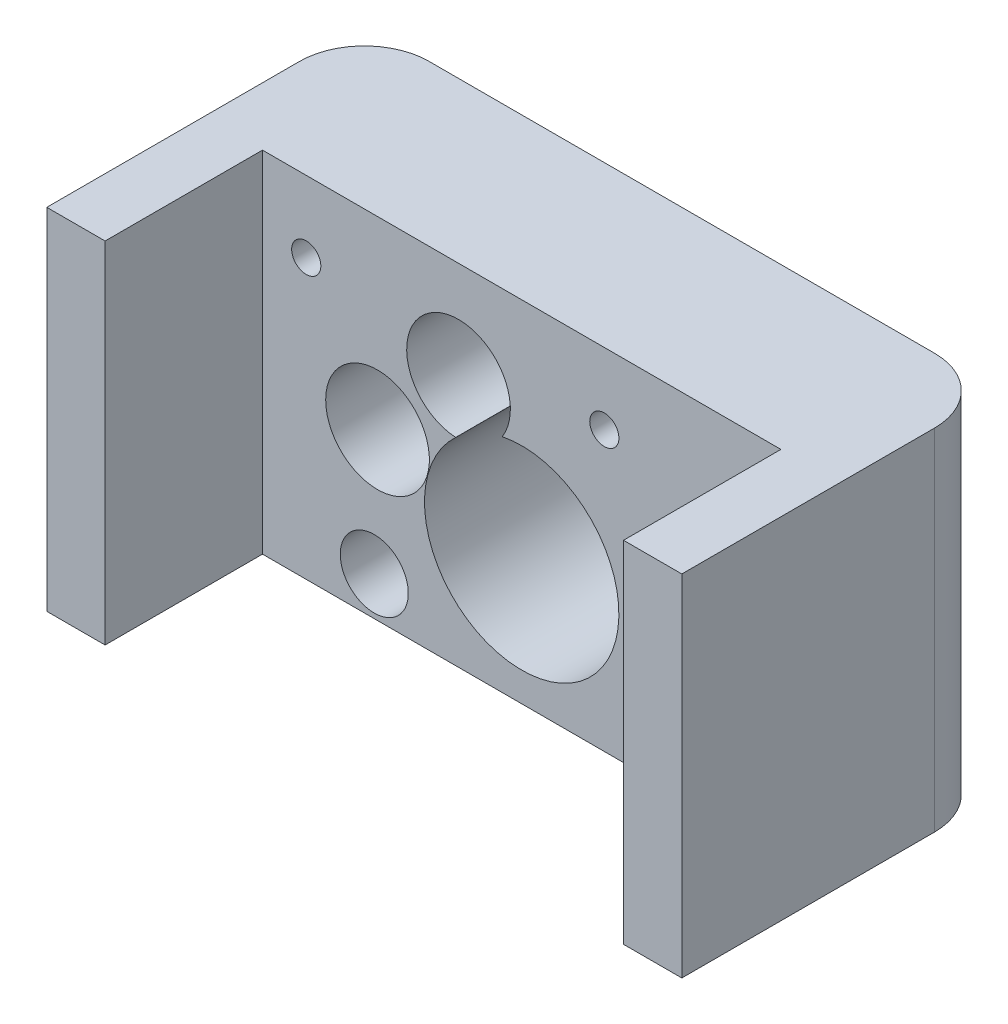
ISO-10303-21;
HEADER;
FILE_DESCRIPTION(('STEP AP214'),'2;1');
FILE_NAME('part.step','',(''),(''),'','','');
FILE_SCHEMA(('AUTOMOTIVE_DESIGN { 1 0 10303 214 1 1 1 1 }'));
ENDSEC;
DATA;
#1=APPLICATION_CONTEXT('core data for automotive mechanical design processes');
#2=APPLICATION_PROTOCOL_DEFINITION('international standard','automotive_design',2000,#1);
#3=PRODUCT_CONTEXT('',#1,'mechanical');
#4=PRODUCT('Part','Part','',(#3));
#5=PRODUCT_RELATED_PRODUCT_CATEGORY('part','',(#4));
#6=PRODUCT_DEFINITION_FORMATION('','',#4);
#7=PRODUCT_DEFINITION_CONTEXT('part definition',#1,'design');
#8=PRODUCT_DEFINITION('design','',#6,#7);
#9=PRODUCT_DEFINITION_SHAPE('','',#8);
#10=(LENGTH_UNIT() NAMED_UNIT(*) SI_UNIT(.MILLI.,.METRE.));
#11=(NAMED_UNIT(*) PLANE_ANGLE_UNIT() SI_UNIT($,.RADIAN.));
#12=(NAMED_UNIT(*) SI_UNIT($,.STERADIAN.) SOLID_ANGLE_UNIT());
#13=UNCERTAINTY_MEASURE_WITH_UNIT(LENGTH_MEASURE(1.E-05),#10,'distance_accuracy_value','');
#14=(GEOMETRIC_REPRESENTATION_CONTEXT(3) GLOBAL_UNCERTAINTY_ASSIGNED_CONTEXT((#13)) GLOBAL_UNIT_ASSIGNED_CONTEXT((#10,
#11,#12)) REPRESENTATION_CONTEXT('',''));
#15=CARTESIAN_POINT('',(0.,0.,0.));
#16=DIRECTION('',(0.,0.,1.));
#17=DIRECTION('',(1.,0.,0.));
#18=AXIS2_PLACEMENT_3D('',#15,#16,#17);
#19=CARTESIAN_POINT('',(0.,0.,49.));
#20=DIRECTION('',(0.,0.,1.));
#21=DIRECTION('',(1.,0.,0.));
#22=AXIS2_PLACEMENT_3D('',#19,#20,#21);
#23=PLANE('',#22);
#24=DIRECTION('',(0.,-1.,0.));
#25=VECTOR('',#24,1.);
#26=CARTESIAN_POINT('',(-35.5216278441966,41.4342339093289,49.));
#27=LINE('',#26,#25);
#28=CARTESIAN_POINT('',(-35.5216278441966,41.4342339093289,49.));
#29=VERTEX_POINT('',#28);
#30=CARTESIAN_POINT('',(-35.5216278441966,-12.5657660906711,49.));
#31=VERTEX_POINT('',#30);
#32=EDGE_CURVE('E125',#29,#31,#27,.T.);
#33=ORIENTED_EDGE('',*,*,#32,.T.);
#34=DIRECTION('',(1.,0.,0.));
#35=VECTOR('',#34,1.);
#36=CARTESIAN_POINT('',(0.,-12.5657660906711,49.));
#37=LINE('',#36,#35);
#38=CARTESIAN_POINT('',(-26.5219738470243,-12.5657660906711,49.));
#39=VERTEX_POINT('',#38);
#40=EDGE_CURVE('E182',#31,#39,#37,.T.);
#41=ORIENTED_EDGE('',*,*,#40,.T.);
#42=DIRECTION('',(0.,1.,0.));
#43=VECTOR('',#42,1.);
#44=CARTESIAN_POINT('',(-26.5219738470243,0.,49.));
#45=LINE('',#44,#43);
#46=CARTESIAN_POINT('',(-26.5219738470243,41.4342339093289,49.));
#47=VERTEX_POINT('',#46);
#48=EDGE_CURVE('E147',#39,#47,#45,.T.);
#49=ORIENTED_EDGE('',*,*,#48,.T.);
#50=DIRECTION('',(-1.,0.,0.));
#51=VECTOR('',#50,1.);
#52=CARTESIAN_POINT('',(0.,41.4342339093289,49.));
#53=LINE('',#52,#51);
#54=EDGE_CURVE('E142',#47,#29,#53,.T.);
#55=ORIENTED_EDGE('',*,*,#54,.T.);
#56=EDGE_LOOP('',(#33,#41,#49,#55));
#57=FACE_BOUND('',#56,.T.);
#58=ADVANCED_FACE('F35',(#57),#23,.T.);
#59=CARTESIAN_POINT('',(0.,-12.5657660906711,49.));
#60=DIRECTION('',(0.,1.,0.));
#61=DIRECTION('',(0.,0.,1.));
#62=AXIS2_PLACEMENT_3D('',#59,#60,#61);
#63=PLANE('',#62);
#64=ORIENTED_EDGE('',*,*,#40,.F.);
#65=DIRECTION('',(0.,0.,1.));
#66=VECTOR('',#65,1.);
#67=CARTESIAN_POINT('',(-35.5216278441966,-12.5657660906711,49.));
#68=LINE('',#67,#66);
#69=CARTESIAN_POINT('',(-35.5216278441966,-12.5657660906711,24.7098819042502));
#70=VERTEX_POINT('',#69);
#71=EDGE_CURVE('E131',#70,#31,#68,.T.);
#72=ORIENTED_EDGE('',*,*,#71,.F.);
#73=DIRECTION('',(1.,0.,0.));
#74=VECTOR('',#73,1.);
#75=CARTESIAN_POINT('',(-35.5216278441966,-12.5657660906711,24.7098819042502));
#76=LINE('',#75,#74);
#77=CARTESIAN_POINT('',(-115.521627845181,-12.5657660906711,24.7098819042502));
#78=VERTEX_POINT('',#77);
#79=EDGE_CURVE('E144',#78,#70,#76,.T.);
#80=ORIENTED_EDGE('',*,*,#79,.F.);
#81=DIRECTION('',(0.,0.,-1.));
#82=VECTOR('',#81,1.);
#83=CARTESIAN_POINT('',(-115.521627845181,-12.5657660906711,49.));
#84=LINE('',#83,#82);
#85=CARTESIAN_POINT('',(-115.521627845181,-12.5657660906711,49.));
#86=VERTEX_POINT('',#85);
#87=EDGE_CURVE('E258',#86,#78,#84,.T.);
#88=ORIENTED_EDGE('',*,*,#87,.F.);
#89=CARTESIAN_POINT('',(-124.521973847024,-12.5657660906711,49.));
#90=VERTEX_POINT('',#89);
#91=EDGE_CURVE('E236',#90,#86,#37,.T.);
#92=ORIENTED_EDGE('',*,*,#91,.F.);
#93=DIRECTION('',(0.,0.,-1.));
#94=VECTOR('',#93,1.);
#95=CARTESIAN_POINT('',(-124.521973847024,-12.5657660906711,49.));
#96=LINE('',#95,#94);
#97=CARTESIAN_POINT('',(-124.521973847024,-12.5657660906711,10.));
#98=VERTEX_POINT('',#97);
#99=EDGE_CURVE('E183',#90,#98,#96,.T.);
#100=ORIENTED_EDGE('',*,*,#99,.T.);
#101=CARTESIAN_POINT('',(-114.521973847024,-12.5657660906711,10.));
#102=DIRECTION('',(0.,1.,0.));
#103=DIRECTION('',(0.,0.,1.));
#104=AXIS2_PLACEMENT_3D('',#101,#102,#103);
#105=CIRCLE('',#104,10.);
#106=CARTESIAN_POINT('',(-114.521973847024,-12.5657660906711,0.));
#107=VERTEX_POINT('',#106);
#108=EDGE_CURVE('E202',#98,#107,#105,.F.);
#109=ORIENTED_EDGE('',*,*,#108,.T.);
#110=DIRECTION('',(1.,0.,0.));
#111=VECTOR('',#110,1.);
#112=CARTESIAN_POINT('',(0.,-12.5657660906711,0.));
#113=LINE('',#112,#111);
#114=CARTESIAN_POINT('',(-36.5219738470243,-12.5657660906711,0.));
#115=VERTEX_POINT('',#114);
#116=EDGE_CURVE('E173',#107,#115,#113,.T.);
#117=ORIENTED_EDGE('',*,*,#116,.T.);
#118=CARTESIAN_POINT('',(-36.5219738470243,-12.5657660906711,10.));
#119=DIRECTION('',(0.,1.,0.));
#120=DIRECTION('',(0.,0.,1.));
#121=AXIS2_PLACEMENT_3D('',#118,#119,#120);
#122=CIRCLE('',#121,10.);
#123=CARTESIAN_POINT('',(-26.5219738470243,-12.5657660906711,10.));
#124=VERTEX_POINT('',#123);
#125=EDGE_CURVE('E200',#115,#124,#122,.F.);
#126=ORIENTED_EDGE('',*,*,#125,.T.);
#127=DIRECTION('',(0.,0.,-1.));
#128=VECTOR('',#127,1.);
#129=CARTESIAN_POINT('',(-26.5219738470243,-12.5657660906711,49.));
#130=LINE('',#129,#128);
#131=EDGE_CURVE('E192',#39,#124,#130,.T.);
#132=ORIENTED_EDGE('',*,*,#131,.F.);
#133=EDGE_LOOP('',(#64,#72,#80,#88,#92,#100,#109,#117,#126,#132));
#134=FACE_BOUND('',#133,.T.);
#135=ADVANCED_FACE('F224',(#134),#63,.F.);
#136=CARTESIAN_POINT('',(-26.5219738470243,0.,49.));
#137=DIRECTION('',(-1.,0.,0.));
#138=DIRECTION('',(0.,0.,1.));
#139=AXIS2_PLACEMENT_3D('',#136,#137,#138);
#140=PLANE('',#139);
#141=ORIENTED_EDGE('',*,*,#131,.T.);
#142=DIRECTION('',(0.,1.,0.));
#143=VECTOR('',#142,1.);
#144=CARTESIAN_POINT('',(-26.5219738470243,0.,10.));
#145=LINE('',#144,#143);
#146=CARTESIAN_POINT('',(-26.5219738470243,41.4342339093289,10.));
#147=VERTEX_POINT('',#146);
#148=EDGE_CURVE('E11',#124,#147,#145,.T.);
#149=ORIENTED_EDGE('',*,*,#148,.T.);
#150=DIRECTION('',(0.,0.,-1.));
#151=VECTOR('',#150,1.);
#152=CARTESIAN_POINT('',(-26.5219738470243,41.4342339093289,49.));
#153=LINE('',#152,#151);
#154=EDGE_CURVE('E190',#47,#147,#153,.T.);
#155=ORIENTED_EDGE('',*,*,#154,.F.);
#156=ORIENTED_EDGE('',*,*,#48,.F.);
#157=EDGE_LOOP('',(#141,#149,#155,#156));
#158=FACE_BOUND('',#157,.T.);
#159=ADVANCED_FACE('F235',(#158),#140,.F.);
#160=CARTESIAN_POINT('',(0.,41.4342339093289,49.));
#161=DIRECTION('',(0.,-1.,0.));
#162=DIRECTION('',(0.,0.,-1.));
#163=AXIS2_PLACEMENT_3D('',#160,#161,#162);
#164=PLANE('',#163);
#165=DIRECTION('',(1.,0.,0.));
#166=VECTOR('',#165,1.);
#167=CARTESIAN_POINT('',(-35.5216278441966,41.4342339093289,24.7098819042502));
#168=LINE('',#167,#166);
#169=CARTESIAN_POINT('',(-115.521627845181,41.4342339093289,24.7098819042502));
#170=VERTEX_POINT('',#169);
#171=CARTESIAN_POINT('',(-35.5216278441966,41.4342339093289,24.7098819042502));
#172=VERTEX_POINT('',#171);
#173=EDGE_CURVE('E136',#170,#172,#168,.T.);
#174=ORIENTED_EDGE('',*,*,#173,.T.);
#175=DIRECTION('',(0.,0.,1.));
#176=VECTOR('',#175,1.);
#177=CARTESIAN_POINT('',(-35.5216278441966,41.4342339093289,49.));
#178=LINE('',#177,#176);
#179=EDGE_CURVE('E128',#172,#29,#178,.T.);
#180=ORIENTED_EDGE('',*,*,#179,.T.);
#181=ORIENTED_EDGE('',*,*,#54,.F.);
#182=ORIENTED_EDGE('',*,*,#154,.T.);
#183=CARTESIAN_POINT('',(-36.5219738470243,41.4342339093289,10.));
#184=DIRECTION('',(0.,-1.,0.));
#185=DIRECTION('',(0.,0.,-1.));
#186=AXIS2_PLACEMENT_3D('',#183,#184,#185);
#187=CIRCLE('',#186,10.);
#188=CARTESIAN_POINT('',(-36.5219738470243,41.4342339093289,0.));
#189=VERTEX_POINT('',#188);
#190=EDGE_CURVE('E208',#147,#189,#187,.F.);
#191=ORIENTED_EDGE('',*,*,#190,.T.);
#192=DIRECTION('',(-1.,0.,0.));
#193=VECTOR('',#192,1.);
#194=CARTESIAN_POINT('',(0.,41.4342339093289,0.));
#195=LINE('',#194,#193);
#196=CARTESIAN_POINT('',(-114.521973847024,41.4342339093289,0.));
#197=VERTEX_POINT('',#196);
#198=EDGE_CURVE('E176',#189,#197,#195,.T.);
#199=ORIENTED_EDGE('',*,*,#198,.T.);
#200=CARTESIAN_POINT('',(-114.521973847024,41.4342339093289,10.));
#201=DIRECTION('',(0.,-1.,0.));
#202=DIRECTION('',(0.,0.,-1.));
#203=AXIS2_PLACEMENT_3D('',#200,#201,#202);
#204=CIRCLE('',#203,10.);
#205=CARTESIAN_POINT('',(-124.521973847024,41.4342339093289,10.));
#206=VERTEX_POINT('',#205);
#207=EDGE_CURVE('E44',#197,#206,#204,.F.);
#208=ORIENTED_EDGE('',*,*,#207,.T.);
#209=DIRECTION('',(0.,0.,-1.));
#210=VECTOR('',#209,1.);
#211=CARTESIAN_POINT('',(-124.521973847024,41.4342339093289,49.));
#212=LINE('',#211,#210);
#213=CARTESIAN_POINT('',(-124.521973847024,41.4342339093289,49.));
#214=VERTEX_POINT('',#213);
#215=EDGE_CURVE('E186',#214,#206,#212,.T.);
#216=ORIENTED_EDGE('',*,*,#215,.F.);
#217=CARTESIAN_POINT('',(-115.521627845181,41.4342339093289,49.));
#218=VERTEX_POINT('',#217);
#219=EDGE_CURVE('E150',#218,#214,#53,.T.);
#220=ORIENTED_EDGE('',*,*,#219,.F.);
#221=DIRECTION('',(0.,0.,-1.));
#222=VECTOR('',#221,1.);
#223=CARTESIAN_POINT('',(-115.521627845181,41.4342339093289,49.));
#224=LINE('',#223,#222);
#225=EDGE_CURVE('E58',#218,#170,#224,.T.);
#226=ORIENTED_EDGE('',*,*,#225,.T.);
#227=EDGE_LOOP('',(#174,#180,#181,#182,#191,#199,#208,#216,#220,#226));
#228=FACE_BOUND('',#227,.T.);
#229=ADVANCED_FACE('F140',(#228),#164,.F.);
#230=CARTESIAN_POINT('',(-85.2719738470245,25.9342339093289,49.));
#231=DIRECTION('',(0.,0.,-1.));
#232=DIRECTION('',(-1.,0.,0.));
#233=AXIS2_PLACEMENT_3D('',#230,#231,#232);
#234=CYLINDRICAL_SURFACE('',#233,8.00000000000004);
#235=CARTESIAN_POINT('',(-85.2719738470245,25.9342339093289,24.7098819042502));
#236=DIRECTION('',(0.,0.,-1.));
#237=DIRECTION('',(-1.,0.,0.));
#238=AXIS2_PLACEMENT_3D('',#235,#236,#237);
#239=CIRCLE('',#238,8.00000000000004);
#240=CARTESIAN_POINT('',(-85.7072176102892,17.9460825044957,24.7098819042502));
#241=VERTEX_POINT('',#240);
#242=CARTESIAN_POINT('',(-78.5286925340817,21.6297993199179,24.7098819042502));
#243=VERTEX_POINT('',#242);
#244=EDGE_CURVE('E50',#241,#243,#239,.T.);
#245=ORIENTED_EDGE('',*,*,#244,.F.);
#246=DIRECTION('',(0.,0.,-1.));
#247=VECTOR('',#246,1.);
#248=CARTESIAN_POINT('',(-85.7072176102892,17.9460825044957,49.));
#249=LINE('',#248,#247);
#250=CARTESIAN_POINT('',(-85.7072176102892,17.9460825044957,0.));
#251=VERTEX_POINT('',#250);
#252=EDGE_CURVE('E152',#241,#251,#249,.T.);
#253=ORIENTED_EDGE('',*,*,#252,.T.);
#254=CARTESIAN_POINT('',(-85.2719738470245,25.9342339093289,0.));
#255=DIRECTION('',(0.,0.,1.));
#256=DIRECTION('',(1.,0.,0.));
#257=AXIS2_PLACEMENT_3D('',#254,#255,#256);
#258=CIRCLE('',#257,8.00000000000004);
#259=CARTESIAN_POINT('',(-78.5286925340817,21.6297993199179,0.));
#260=VERTEX_POINT('',#259);
#261=EDGE_CURVE('E164',#260,#251,#258,.T.);
#262=ORIENTED_EDGE('',*,*,#261,.F.);
#263=DIRECTION('',(0.,0.,-1.));
#264=VECTOR('',#263,1.);
#265=CARTESIAN_POINT('',(-78.5286925340817,21.6297993199179,49.));
#266=LINE('',#265,#264);
#267=EDGE_CURVE('E187',#243,#260,#266,.T.);
#268=ORIENTED_EDGE('',*,*,#267,.F.);
#269=EDGE_LOOP('',(#245,#253,#262,#268));
#270=FACE_BOUND('',#269,.T.);
#271=ADVANCED_FACE('F309',(#270),#234,.F.);
#272=CARTESIAN_POINT('',(-124.521973847024,-2.2401160580027E-13,49.));
#273=DIRECTION('',(1.,0.,0.));
#274=DIRECTION('',(0.,1.,0.));
#275=AXIS2_PLACEMENT_3D('',#272,#273,#274);
#276=PLANE('',#275);
#277=ORIENTED_EDGE('',*,*,#215,.T.);
#278=DIRECTION('',(0.,-1.,0.));
#279=VECTOR('',#278,1.);
#280=CARTESIAN_POINT('',(-124.521973847024,-2.2401160580027E-13,10.));
#281=LINE('',#280,#279);
#282=EDGE_CURVE('E195',#206,#98,#281,.T.);
#283=ORIENTED_EDGE('',*,*,#282,.T.);
#284=ORIENTED_EDGE('',*,*,#99,.F.);
#285=DIRECTION('',(0.,-1.,0.));
#286=VECTOR('',#285,1.);
#287=CARTESIAN_POINT('',(-124.521973847024,-2.2401160580027E-13,49.));
#288=LINE('',#287,#286);
#289=EDGE_CURVE('E149',#214,#90,#288,.T.);
#290=ORIENTED_EDGE('',*,*,#289,.F.);
#291=EDGE_LOOP('',(#277,#283,#284,#290));
#292=FACE_BOUND('',#291,.T.);
#293=ADVANCED_FACE('F219',(#292),#276,.F.);
#294=CARTESIAN_POINT('',(-98.2719738470244,-6.56576609067107,49.));
#295=DIRECTION('',(0.,0.,-1.));
#296=DIRECTION('',(-1.,0.,0.));
#297=AXIS2_PLACEMENT_3D('',#294,#295,#296);
#298=CYLINDRICAL_SURFACE('',#297,5.25);
#299=CARTESIAN_POINT('',(-98.2719738470244,-6.56576609067107,24.7098819042502));
#300=DIRECTION('',(0.,0.,-1.));
#301=DIRECTION('',(-1.,0.,0.));
#302=AXIS2_PLACEMENT_3D('',#299,#300,#301);
#303=CIRCLE('',#302,5.25);
#304=CARTESIAN_POINT('',(-103.521973847024,-6.56576609067107,24.7098819042502));
#305=VERTEX_POINT('',#304);
#306=EDGE_CURVE('E161',#305,#305,#303,.T.);
#307=ORIENTED_EDGE('',*,*,#306,.F.);
#308=EDGE_LOOP('',(#307));
#309=FACE_BOUND('',#308,.T.);
#310=CARTESIAN_POINT('',(-98.2719738470244,-6.56576609067107,0.));
#311=DIRECTION('',(0.,0.,1.));
#312=DIRECTION('',(1.,0.,0.));
#313=AXIS2_PLACEMENT_3D('',#310,#311,#312);
#314=CIRCLE('',#313,5.25);
#315=CARTESIAN_POINT('',(-93.0219738470244,-6.56576609067107,0.));
#316=VERTEX_POINT('',#315);
#317=EDGE_CURVE('E170',#316,#316,#314,.T.);
#318=ORIENTED_EDGE('',*,*,#317,.F.);
#319=EDGE_LOOP('',(#318));
#320=FACE_BOUND('',#319,.T.);
#321=ADVANCED_FACE('F308',(#309,#320),#298,.F.);
#322=CARTESIAN_POINT('',(-75.5219738470245,6.93423390932889,49.));
#323=DIRECTION('',(0.,0.,-1.));
#324=DIRECTION('',(-1.,0.,0.));
#325=AXIS2_PLACEMENT_3D('',#322,#323,#324);
#326=CYLINDRICAL_SURFACE('',#325,15.);
#327=CARTESIAN_POINT('',(-75.5219738470245,6.93423390932889,24.7098819042502));
#328=DIRECTION('',(0.,0.,-1.));
#329=DIRECTION('',(-1.,0.,0.));
#330=AXIS2_PLACEMENT_3D('',#327,#328,#329);
#331=CIRCLE('',#330,15.);
#332=EDGE_CURVE('E243',#243,#241,#331,.T.);
#333=ORIENTED_EDGE('',*,*,#332,.F.);
#334=ORIENTED_EDGE('',*,*,#267,.T.);
#335=CARTESIAN_POINT('',(-75.5219738470245,6.93423390932889,0.));
#336=DIRECTION('',(0.,0.,1.));
#337=DIRECTION('',(1.,0.,0.));
#338=AXIS2_PLACEMENT_3D('',#335,#336,#337);
#339=CIRCLE('',#338,15.);
#340=EDGE_CURVE('E167',#251,#260,#339,.T.);
#341=ORIENTED_EDGE('',*,*,#340,.F.);
#342=ORIENTED_EDGE('',*,*,#252,.F.);
#343=EDGE_LOOP('',(#333,#334,#341,#342));
#344=FACE_BOUND('',#343,.T.);
#345=ADVANCED_FACE('F316',(#344),#326,.F.);
#346=CARTESIAN_POINT('',(-97.7719738470245,12.9342339093289,49.));
#347=DIRECTION('',(0.,0.,-1.));
#348=DIRECTION('',(-1.,0.,0.));
#349=AXIS2_PLACEMENT_3D('',#346,#347,#348);
#350=CYLINDRICAL_SURFACE('',#349,8.00000000000001);
#351=CARTESIAN_POINT('',(-97.7719738470245,12.9342339093289,24.7098819042502));
#352=DIRECTION('',(0.,0.,-1.));
#353=DIRECTION('',(-1.,0.,0.));
#354=AXIS2_PLACEMENT_3D('',#351,#352,#353);
#355=CIRCLE('',#354,8.00000000000001);
#356=CARTESIAN_POINT('',(-105.771973847024,12.9342339093289,24.7098819042502));
#357=VERTEX_POINT('',#356);
#358=EDGE_CURVE('E245',#357,#357,#355,.T.);
#359=ORIENTED_EDGE('',*,*,#358,.F.);
#360=EDGE_LOOP('',(#359));
#361=FACE_BOUND('',#360,.T.);
#362=CARTESIAN_POINT('',(-97.7719738470245,12.9342339093289,0.));
#363=DIRECTION('',(0.,0.,1.));
#364=DIRECTION('',(1.,0.,0.));
#365=AXIS2_PLACEMENT_3D('',#362,#363,#364);
#366=CIRCLE('',#365,8.00000000000001);
#367=CARTESIAN_POINT('',(-89.7719738470245,12.9342339093289,0.));
#368=VERTEX_POINT('',#367);
#369=EDGE_CURVE('E160',#368,#368,#366,.T.);
#370=ORIENTED_EDGE('',*,*,#369,.F.);
#371=EDGE_LOOP('',(#370));
#372=FACE_BOUND('',#371,.T.);
#373=ADVANCED_FACE('F300',(#361,#372),#350,.F.);
#374=CARTESIAN_POINT('',(-108.771973847024,30.4342339093289,49.));
#375=DIRECTION('',(0.,0.,-1.));
#376=DIRECTION('',(-1.,0.,0.));
#377=AXIS2_PLACEMENT_3D('',#374,#375,#376);
#378=CYLINDRICAL_SURFACE('',#377,2.25000000000001);
#379=CARTESIAN_POINT('',(-108.771973847024,30.4342339093289,24.7098819042502));
#380=DIRECTION('',(0.,0.,-1.));
#381=DIRECTION('',(-1.,0.,0.));
#382=AXIS2_PLACEMENT_3D('',#379,#380,#381);
#383=CIRCLE('',#382,2.25000000000001);
#384=CARTESIAN_POINT('',(-111.021973847024,30.4342339093289,24.7098819042502));
#385=VERTEX_POINT('',#384);
#386=EDGE_CURVE('E248',#385,#385,#383,.T.);
#387=ORIENTED_EDGE('',*,*,#386,.F.);
#388=EDGE_LOOP('',(#387));
#389=FACE_BOUND('',#388,.T.);
#390=CARTESIAN_POINT('',(-108.771973847024,30.4342339093289,0.));
#391=DIRECTION('',(0.,0.,1.));
#392=DIRECTION('',(1.,0.,0.));
#393=AXIS2_PLACEMENT_3D('',#390,#391,#392);
#394=CIRCLE('',#393,2.25000000000001);
#395=CARTESIAN_POINT('',(-106.521973847024,30.4342339093289,0.));
#396=VERTEX_POINT('',#395);
#397=EDGE_CURVE('E157',#396,#396,#394,.T.);
#398=ORIENTED_EDGE('',*,*,#397,.F.);
#399=EDGE_LOOP('',(#398));
#400=FACE_BOUND('',#399,.T.);
#401=ADVANCED_FACE('F294',(#389,#400),#378,.F.);
#402=CARTESIAN_POINT('',(-62.7719738470244,30.4342339093289,49.));
#403=DIRECTION('',(0.,0.,-1.));
#404=DIRECTION('',(-1.,0.,0.));
#405=AXIS2_PLACEMENT_3D('',#402,#403,#404);
#406=CYLINDRICAL_SURFACE('',#405,2.25);
#407=CARTESIAN_POINT('',(-62.7719738470244,30.4342339093289,24.7098819042502));
#408=DIRECTION('',(0.,0.,-1.));
#409=DIRECTION('',(-1.,0.,0.));
#410=AXIS2_PLACEMENT_3D('',#407,#408,#409);
#411=CIRCLE('',#410,2.25);
#412=CARTESIAN_POINT('',(-65.0219738470244,30.4342339093289,24.7098819042502));
#413=VERTEX_POINT('',#412);
#414=EDGE_CURVE('E39',#413,#413,#411,.T.);
#415=ORIENTED_EDGE('',*,*,#414,.F.);
#416=EDGE_LOOP('',(#415));
#417=FACE_BOUND('',#416,.T.);
#418=CARTESIAN_POINT('',(-62.7719738470244,30.4342339093289,0.));
#419=DIRECTION('',(0.,0.,1.));
#420=DIRECTION('',(1.,0.,0.));
#421=AXIS2_PLACEMENT_3D('',#418,#419,#420);
#422=CIRCLE('',#421,2.25);
#423=CARTESIAN_POINT('',(-60.5219738470244,30.4342339093289,0.));
#424=VERTEX_POINT('',#423);
#425=EDGE_CURVE('E179',#424,#424,#422,.T.);
#426=ORIENTED_EDGE('',*,*,#425,.F.);
#427=EDGE_LOOP('',(#426));
#428=FACE_BOUND('',#427,.T.);
#429=ADVANCED_FACE('F287',(#417,#428),#406,.F.);
#430=DIRECTION('',(0.,-1.,0.));
#431=VECTOR('',#430,1.);
#432=CARTESIAN_POINT('',(-115.521627845181,41.4342339093289,49.));
#433=LINE('',#432,#431);
#434=EDGE_CURVE('E135',#218,#86,#433,.T.);
#435=ORIENTED_EDGE('',*,*,#434,.F.);
#436=ORIENTED_EDGE('',*,*,#219,.T.);
#437=ORIENTED_EDGE('',*,*,#289,.T.);
#438=ORIENTED_EDGE('',*,*,#91,.T.);
#439=EDGE_LOOP('',(#435,#436,#437,#438));
#440=FACE_BOUND('',#439,.T.);
#441=ADVANCED_FACE('F263',(#440),#23,.T.);
#442=CARTESIAN_POINT('',(0.,0.,0.));
#443=DIRECTION('',(0.,0.,1.));
#444=DIRECTION('',(1.,0.,0.));
#445=AXIS2_PLACEMENT_3D('',#442,#443,#444);
#446=PLANE('',#445);
#447=ORIENTED_EDGE('',*,*,#397,.T.);
#448=EDGE_LOOP('',(#447));
#449=FACE_BOUND('',#448,.T.);
#450=ORIENTED_EDGE('',*,*,#369,.T.);
#451=EDGE_LOOP('',(#450));
#452=FACE_BOUND('',#451,.T.);
#453=ORIENTED_EDGE('',*,*,#261,.T.);
#454=ORIENTED_EDGE('',*,*,#340,.T.);
#455=EDGE_LOOP('',(#453,#454));
#456=FACE_BOUND('',#455,.T.);
#457=ORIENTED_EDGE('',*,*,#317,.T.);
#458=EDGE_LOOP('',(#457));
#459=FACE_BOUND('',#458,.T.);
#460=ORIENTED_EDGE('',*,*,#116,.F.);
#461=DIRECTION('',(0.,-1.,0.));
#462=VECTOR('',#461,1.);
#463=CARTESIAN_POINT('',(-114.521973847024,-2.06021880864214E-13,0.));
#464=LINE('',#463,#462);
#465=EDGE_CURVE('E206',#107,#197,#464,.F.);
#466=ORIENTED_EDGE('',*,*,#465,.T.);
#467=ORIENTED_EDGE('',*,*,#198,.F.);
#468=DIRECTION('',(0.,1.,0.));
#469=VECTOR('',#468,1.);
#470=CARTESIAN_POINT('',(-36.5219738470243,0.,0.));
#471=LINE('',#470,#469);
#472=EDGE_CURVE('E204',#189,#115,#471,.F.);
#473=ORIENTED_EDGE('',*,*,#472,.T.);
#474=EDGE_LOOP('',(#460,#466,#467,#473));
#475=FACE_BOUND('',#474,.T.);
#476=ORIENTED_EDGE('',*,*,#425,.T.);
#477=EDGE_LOOP('',(#476));
#478=FACE_BOUND('',#477,.T.);
#479=ADVANCED_FACE('F228',(#449,#452,#456,#459,#475,#478),#446,.F.);
#480=CARTESIAN_POINT('',(-114.521973847024,-2.06021880864214E-13,10.));
#481=DIRECTION('',(0.,-1.,0.));
#482=DIRECTION('',(1.,0.,0.));
#483=AXIS2_PLACEMENT_3D('',#480,#481,#482);
#484=CYLINDRICAL_SURFACE('',#483,10.);
#485=ORIENTED_EDGE('',*,*,#207,.F.);
#486=ORIENTED_EDGE('',*,*,#465,.F.);
#487=ORIENTED_EDGE('',*,*,#108,.F.);
#488=ORIENTED_EDGE('',*,*,#282,.F.);
#489=EDGE_LOOP('',(#485,#486,#487,#488));
#490=FACE_BOUND('',#489,.T.);
#491=ADVANCED_FACE('F221',(#490),#484,.T.);
#492=CARTESIAN_POINT('',(-36.5219738470243,0.,10.));
#493=DIRECTION('',(0.,1.,0.));
#494=DIRECTION('',(0.,0.,1.));
#495=AXIS2_PLACEMENT_3D('',#492,#493,#494);
#496=CYLINDRICAL_SURFACE('',#495,10.);
#497=ORIENTED_EDGE('',*,*,#125,.F.);
#498=ORIENTED_EDGE('',*,*,#472,.F.);
#499=ORIENTED_EDGE('',*,*,#190,.F.);
#500=ORIENTED_EDGE('',*,*,#148,.F.);
#501=EDGE_LOOP('',(#497,#498,#499,#500));
#502=FACE_BOUND('',#501,.T.);
#503=ADVANCED_FACE('F37',(#502),#496,.T.);
#504=CARTESIAN_POINT('',(-35.5216278441966,41.4342339093289,49.));
#505=DIRECTION('',(1.,0.,0.));
#506=DIRECTION('',(0.,0.,-1.));
#507=AXIS2_PLACEMENT_3D('',#504,#505,#506);
#508=PLANE('',#507);
#509=ORIENTED_EDGE('',*,*,#71,.T.);
#510=ORIENTED_EDGE('',*,*,#32,.F.);
#511=ORIENTED_EDGE('',*,*,#179,.F.);
#512=DIRECTION('',(0.,-1.,0.));
#513=VECTOR('',#512,1.);
#514=CARTESIAN_POINT('',(-35.5216278441966,41.4342339093289,24.7098819042502));
#515=LINE('',#514,#513);
#516=EDGE_CURVE('E254',#172,#70,#515,.T.);
#517=ORIENTED_EDGE('',*,*,#516,.T.);
#518=EDGE_LOOP('',(#509,#510,#511,#517));
#519=FACE_BOUND('',#518,.T.);
#520=ADVANCED_FACE('F127',(#519),#508,.F.);
#521=CARTESIAN_POINT('',(-35.5216278441966,41.4342339093289,24.7098819042502));
#522=DIRECTION('',(0.,0.,-1.));
#523=DIRECTION('',(-1.,0.,0.));
#524=AXIS2_PLACEMENT_3D('',#521,#522,#523);
#525=PLANE('',#524);
#526=ORIENTED_EDGE('',*,*,#306,.T.);
#527=EDGE_LOOP('',(#526));
#528=FACE_BOUND('',#527,.T.);
#529=ORIENTED_EDGE('',*,*,#244,.T.);
#530=ORIENTED_EDGE('',*,*,#332,.T.);
#531=EDGE_LOOP('',(#529,#530));
#532=FACE_BOUND('',#531,.T.);
#533=ORIENTED_EDGE('',*,*,#358,.T.);
#534=EDGE_LOOP('',(#533));
#535=FACE_BOUND('',#534,.T.);
#536=ORIENTED_EDGE('',*,*,#386,.T.);
#537=EDGE_LOOP('',(#536));
#538=FACE_BOUND('',#537,.T.);
#539=ORIENTED_EDGE('',*,*,#414,.T.);
#540=EDGE_LOOP('',(#539));
#541=FACE_BOUND('',#540,.T.);
#542=ORIENTED_EDGE('',*,*,#79,.T.);
#543=ORIENTED_EDGE('',*,*,#516,.F.);
#544=ORIENTED_EDGE('',*,*,#173,.F.);
#545=DIRECTION('',(0.,-1.,0.));
#546=VECTOR('',#545,1.);
#547=CARTESIAN_POINT('',(-115.521627845181,41.4342339093289,24.7098819042502));
#548=LINE('',#547,#546);
#549=EDGE_CURVE('E252',#170,#78,#548,.T.);
#550=ORIENTED_EDGE('',*,*,#549,.T.);
#551=EDGE_LOOP('',(#542,#543,#544,#550));
#552=FACE_BOUND('',#551,.T.);
#553=ADVANCED_FACE('F268',(#528,#532,#535,#538,#541,#552),#525,.F.);
#554=CARTESIAN_POINT('',(-115.521627845181,41.4342339093289,49.));
#555=DIRECTION('',(-1.,0.,0.));
#556=DIRECTION('',(0.,0.,1.));
#557=AXIS2_PLACEMENT_3D('',#554,#555,#556);
#558=PLANE('',#557);
#559=ORIENTED_EDGE('',*,*,#87,.T.);
#560=ORIENTED_EDGE('',*,*,#549,.F.);
#561=ORIENTED_EDGE('',*,*,#225,.F.);
#562=ORIENTED_EDGE('',*,*,#434,.T.);
#563=EDGE_LOOP('',(#559,#560,#561,#562));
#564=FACE_BOUND('',#563,.T.);
#565=ADVANCED_FACE('F265',(#564),#558,.F.);
#566=CLOSED_SHELL('',(#58,#135,#159,#229,#271,#293,#321,#345,#373,#401,#429,#441,#479,#491,#503,
#520,#553,#565));
#567=MANIFOLD_SOLID_BREP('B2',#566);
#568=ADVANCED_BREP_SHAPE_REPRESENTATION('',(#18,#567),#14);
#569=SHAPE_DEFINITION_REPRESENTATION(#9,#568);
ENDSEC;
END-ISO-10303-21;
